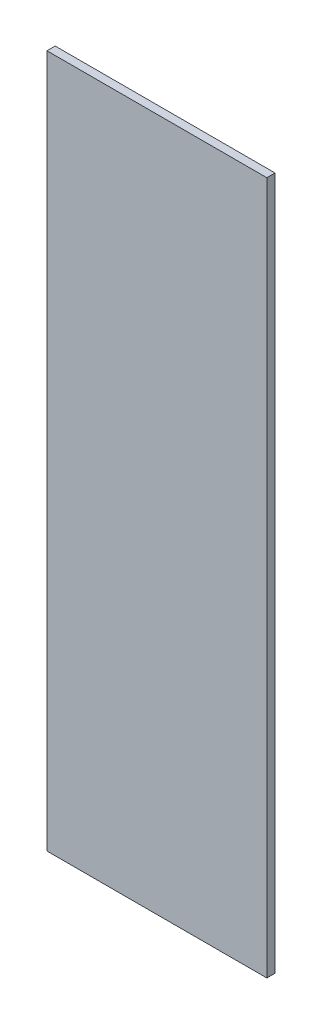
ISO-10303-21;
HEADER;
FILE_DESCRIPTION(('STEP AP214'),'2;1');
FILE_NAME('part.step','',(''),(''),'','','');
FILE_SCHEMA(('AUTOMOTIVE_DESIGN { 1 0 10303 214 1 1 1 1 }'));
ENDSEC;
DATA;
#1=APPLICATION_CONTEXT('core data for automotive mechanical design processes');
#2=APPLICATION_PROTOCOL_DEFINITION('international standard','automotive_design',2000,#1);
#3=PRODUCT_CONTEXT('',#1,'mechanical');
#4=PRODUCT('Part','Part','',(#3));
#5=PRODUCT_RELATED_PRODUCT_CATEGORY('part','',(#4));
#6=PRODUCT_DEFINITION_FORMATION('','',#4);
#7=PRODUCT_DEFINITION_CONTEXT('part definition',#1,'design');
#8=PRODUCT_DEFINITION('design','',#6,#7);
#9=PRODUCT_DEFINITION_SHAPE('','',#8);
#10=(LENGTH_UNIT() NAMED_UNIT(*) SI_UNIT(.MILLI.,.METRE.));
#11=(NAMED_UNIT(*) PLANE_ANGLE_UNIT() SI_UNIT($,.RADIAN.));
#12=(NAMED_UNIT(*) SI_UNIT($,.STERADIAN.) SOLID_ANGLE_UNIT());
#13=UNCERTAINTY_MEASURE_WITH_UNIT(LENGTH_MEASURE(1.E-05),#10,'distance_accuracy_value','');
#14=(GEOMETRIC_REPRESENTATION_CONTEXT(3) GLOBAL_UNCERTAINTY_ASSIGNED_CONTEXT((#13)) GLOBAL_UNIT_ASSIGNED_CONTEXT((#10,
#11,#12)) REPRESENTATION_CONTEXT('',''));
#15=CARTESIAN_POINT('',(0.,0.,0.));
#16=DIRECTION('',(0.,0.,1.));
#17=DIRECTION('',(1.,0.,0.));
#18=AXIS2_PLACEMENT_3D('',#15,#16,#17);
#19=CARTESIAN_POINT('',(0.,0.,3.175));
#20=DIRECTION('',(-1.,0.,0.));
#21=DIRECTION('',(0.,0.,1.));
#22=AXIS2_PLACEMENT_3D('',#19,#20,#21);
#23=PLANE('',#22);
#24=DIRECTION('',(0.,1.,0.));
#25=VECTOR('',#24,1.);
#26=CARTESIAN_POINT('',(0.,0.,0.));
#27=LINE('',#26,#25);
#28=CARTESIAN_POINT('',(0.,0.,0.));
#29=VERTEX_POINT('',#28);
#30=CARTESIAN_POINT('',(0.,267.9,0.));
#31=VERTEX_POINT('',#30);
#32=EDGE_CURVE('E102',#29,#31,#27,.T.);
#33=ORIENTED_EDGE('',*,*,#32,.T.);
#34=DIRECTION('',(0.,0.,-1.));
#35=VECTOR('',#34,1.);
#36=CARTESIAN_POINT('',(0.,267.9,3.175));
#37=LINE('',#36,#35);
#38=CARTESIAN_POINT('',(0.,267.9,3.175));
#39=VERTEX_POINT('',#38);
#40=EDGE_CURVE('E11',#39,#31,#37,.T.);
#41=ORIENTED_EDGE('',*,*,#40,.F.);
#42=DIRECTION('',(0.,1.,0.));
#43=VECTOR('',#42,1.);
#44=CARTESIAN_POINT('',(0.,0.,3.175));
#45=LINE('',#44,#43);
#46=CARTESIAN_POINT('',(0.,0.,3.175));
#47=VERTEX_POINT('',#46);
#48=EDGE_CURVE('E90',#47,#39,#45,.T.);
#49=ORIENTED_EDGE('',*,*,#48,.F.);
#50=DIRECTION('',(0.,0.,-1.));
#51=VECTOR('',#50,1.);
#52=CARTESIAN_POINT('',(0.,0.,3.175));
#53=LINE('',#52,#51);
#54=EDGE_CURVE('E98',#47,#29,#53,.T.);
#55=ORIENTED_EDGE('',*,*,#54,.T.);
#56=EDGE_LOOP('',(#33,#41,#49,#55));
#57=FACE_BOUND('',#56,.T.);
#58=ADVANCED_FACE('F39',(#57),#23,.F.);
#59=CARTESIAN_POINT('',(0.,267.9,3.175));
#60=DIRECTION('',(0.,-1.,0.));
#61=DIRECTION('',(0.,0.,-1.));
#62=AXIS2_PLACEMENT_3D('',#59,#60,#61);
#63=PLANE('',#62);
#64=DIRECTION('',(-1.,0.,0.));
#65=VECTOR('',#64,1.);
#66=CARTESIAN_POINT('',(0.,267.9,0.));
#67=LINE('',#66,#65);
#68=CARTESIAN_POINT('',(-85.,267.9,0.));
#69=VERTEX_POINT('',#68);
#70=EDGE_CURVE('E94',#31,#69,#67,.T.);
#71=ORIENTED_EDGE('',*,*,#70,.T.);
#72=DIRECTION('',(0.,0.,-1.));
#73=VECTOR('',#72,1.);
#74=CARTESIAN_POINT('',(-85.,267.9,3.175));
#75=LINE('',#74,#73);
#76=CARTESIAN_POINT('',(-85.,267.9,3.175));
#77=VERTEX_POINT('',#76);
#78=EDGE_CURVE('E47',#77,#69,#75,.T.);
#79=ORIENTED_EDGE('',*,*,#78,.F.);
#80=DIRECTION('',(-1.,0.,0.));
#81=VECTOR('',#80,1.);
#82=CARTESIAN_POINT('',(0.,267.9,3.175));
#83=LINE('',#82,#81);
#84=EDGE_CURVE('E85',#39,#77,#83,.T.);
#85=ORIENTED_EDGE('',*,*,#84,.F.);
#86=ORIENTED_EDGE('',*,*,#40,.T.);
#87=EDGE_LOOP('',(#71,#79,#85,#86));
#88=FACE_BOUND('',#87,.T.);
#89=ADVANCED_FACE('F93',(#88),#63,.F.);
#90=CARTESIAN_POINT('',(-85.,0.,3.175));
#91=DIRECTION('',(1.,0.,0.));
#92=DIRECTION('',(0.,0.,-1.));
#93=AXIS2_PLACEMENT_3D('',#90,#91,#92);
#94=PLANE('',#93);
#95=DIRECTION('',(0.,-1.,0.));
#96=VECTOR('',#95,1.);
#97=CARTESIAN_POINT('',(-85.,0.,0.));
#98=LINE('',#97,#96);
#99=CARTESIAN_POINT('',(-85.,0.,0.));
#100=VERTEX_POINT('',#99);
#101=EDGE_CURVE('E72',#69,#100,#98,.T.);
#102=ORIENTED_EDGE('',*,*,#101,.T.);
#103=DIRECTION('',(0.,0.,-1.));
#104=VECTOR('',#103,1.);
#105=CARTESIAN_POINT('',(-85.,0.,3.175));
#106=LINE('',#105,#104);
#107=CARTESIAN_POINT('',(-85.,0.,3.175));
#108=VERTEX_POINT('',#107);
#109=EDGE_CURVE('E95',#108,#100,#106,.T.);
#110=ORIENTED_EDGE('',*,*,#109,.F.);
#111=DIRECTION('',(0.,-1.,0.));
#112=VECTOR('',#111,1.);
#113=CARTESIAN_POINT('',(-85.,0.,3.175));
#114=LINE('',#113,#112);
#115=EDGE_CURVE('E88',#77,#108,#114,.T.);
#116=ORIENTED_EDGE('',*,*,#115,.F.);
#117=ORIENTED_EDGE('',*,*,#78,.T.);
#118=EDGE_LOOP('',(#102,#110,#116,#117));
#119=FACE_BOUND('',#118,.T.);
#120=ADVANCED_FACE('F96',(#119),#94,.F.);
#121=CARTESIAN_POINT('',(0.,0.,3.175));
#122=DIRECTION('',(0.,1.,0.));
#123=DIRECTION('',(-1.,0.,0.));
#124=AXIS2_PLACEMENT_3D('',#121,#122,#123);
#125=PLANE('',#124);
#126=DIRECTION('',(1.,0.,0.));
#127=VECTOR('',#126,1.);
#128=CARTESIAN_POINT('',(0.,0.,0.));
#129=LINE('',#128,#127);
#130=EDGE_CURVE('E78',#100,#29,#129,.T.);
#131=ORIENTED_EDGE('',*,*,#130,.T.);
#132=ORIENTED_EDGE('',*,*,#54,.F.);
#133=DIRECTION('',(1.,0.,0.));
#134=VECTOR('',#133,1.);
#135=CARTESIAN_POINT('',(0.,0.,3.175));
#136=LINE('',#135,#134);
#137=EDGE_CURVE('E55',#108,#47,#136,.T.);
#138=ORIENTED_EDGE('',*,*,#137,.F.);
#139=ORIENTED_EDGE('',*,*,#109,.T.);
#140=EDGE_LOOP('',(#131,#132,#138,#139));
#141=FACE_BOUND('',#140,.T.);
#142=ADVANCED_FACE('F109',(#141),#125,.F.);
#143=CARTESIAN_POINT('',(0.,0.,3.175));
#144=DIRECTION('',(0.,0.,1.));
#145=DIRECTION('',(1.,0.,0.));
#146=AXIS2_PLACEMENT_3D('',#143,#144,#145);
#147=PLANE('',#146);
#148=ORIENTED_EDGE('',*,*,#48,.T.);
#149=ORIENTED_EDGE('',*,*,#84,.T.);
#150=ORIENTED_EDGE('',*,*,#115,.T.);
#151=ORIENTED_EDGE('',*,*,#137,.T.);
#152=EDGE_LOOP('',(#148,#149,#150,#151));
#153=FACE_BOUND('',#152,.T.);
#154=ADVANCED_FACE('F86',(#153),#147,.T.);
#155=CARTESIAN_POINT('',(0.,0.,0.));
#156=DIRECTION('',(0.,0.,1.));
#157=DIRECTION('',(1.,0.,0.));
#158=AXIS2_PLACEMENT_3D('',#155,#156,#157);
#159=PLANE('',#158);
#160=ORIENTED_EDGE('',*,*,#32,.F.);
#161=ORIENTED_EDGE('',*,*,#130,.F.);
#162=ORIENTED_EDGE('',*,*,#101,.F.);
#163=ORIENTED_EDGE('',*,*,#70,.F.);
#164=EDGE_LOOP('',(#160,#161,#162,#163));
#165=FACE_BOUND('',#164,.T.);
#166=ADVANCED_FACE('F112',(#165),#159,.F.);
#167=CLOSED_SHELL('',(#58,#89,#120,#142,#154,#166));
#168=MANIFOLD_SOLID_BREP('B2',#167);
#169=ADVANCED_BREP_SHAPE_REPRESENTATION('',(#18,#168),#14);
#170=SHAPE_DEFINITION_REPRESENTATION(#9,#169);
ENDSEC;
END-ISO-10303-21;
